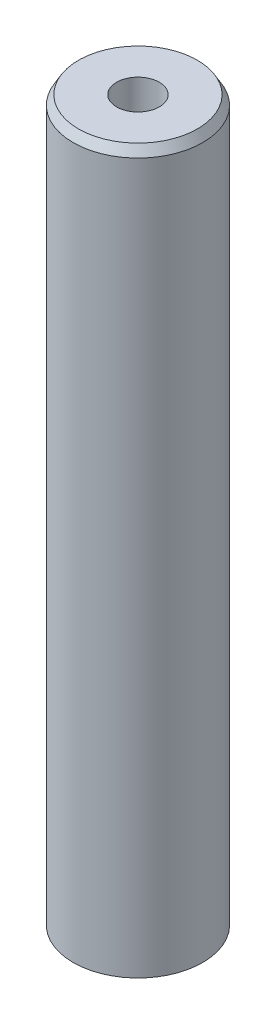
ISO-10303-21;
HEADER;
FILE_DESCRIPTION(('STEP AP214'),'2;1');
FILE_NAME('part.step','',(''),(''),'','','');
FILE_SCHEMA(('AUTOMOTIVE_DESIGN { 1 0 10303 214 1 1 1 1 }'));
ENDSEC;
DATA;
#1=APPLICATION_CONTEXT('core data for automotive mechanical design processes');
#2=APPLICATION_PROTOCOL_DEFINITION('international standard','automotive_design',2000,#1);
#3=PRODUCT_CONTEXT('',#1,'mechanical');
#4=PRODUCT('Part','Part','',(#3));
#5=PRODUCT_RELATED_PRODUCT_CATEGORY('part','',(#4));
#6=PRODUCT_DEFINITION_FORMATION('','',#4);
#7=PRODUCT_DEFINITION_CONTEXT('part definition',#1,'design');
#8=PRODUCT_DEFINITION('design','',#6,#7);
#9=PRODUCT_DEFINITION_SHAPE('','',#8);
#10=(LENGTH_UNIT() NAMED_UNIT(*) SI_UNIT(.MILLI.,.METRE.));
#11=(NAMED_UNIT(*) PLANE_ANGLE_UNIT() SI_UNIT($,.RADIAN.));
#12=(NAMED_UNIT(*) SI_UNIT($,.STERADIAN.) SOLID_ANGLE_UNIT());
#13=UNCERTAINTY_MEASURE_WITH_UNIT(LENGTH_MEASURE(1.E-05),#10,'distance_accuracy_value','');
#14=(GEOMETRIC_REPRESENTATION_CONTEXT(3) GLOBAL_UNCERTAINTY_ASSIGNED_CONTEXT((#13)) GLOBAL_UNIT_ASSIGNED_CONTEXT((#10,
#11,#12)) REPRESENTATION_CONTEXT('',''));
#15=CARTESIAN_POINT('',(0.,0.,0.));
#16=DIRECTION('',(0.,0.,1.));
#17=DIRECTION('',(1.,0.,0.));
#18=AXIS2_PLACEMENT_3D('',#15,#16,#17);
#19=CARTESIAN_POINT('',(0.,111.814988323432,0.));
#20=DIRECTION('',(0.,-1.,0.));
#21=DIRECTION('',(0.,0.,-1.));
#22=AXIS2_PLACEMENT_3D('',#19,#20,#21);
#23=CYLINDRICAL_SURFACE('',#22,10.);
#24=CARTESIAN_POINT('',(0.,110.394560322093,0.));
#25=DIRECTION('',(0.,1.,0.));
#26=DIRECTION('',(0.,0.,1.));
#27=AXIS2_PLACEMENT_3D('',#24,#25,#26);
#28=CIRCLE('',#27,10.);
#29=CARTESIAN_POINT('',(0.,110.394560322093,10.));
#30=VERTEX_POINT('',#29);
#31=EDGE_CURVE('E50',#30,#30,#28,.F.);
#32=ORIENTED_EDGE('',*,*,#31,.T.);
#33=EDGE_LOOP('',(#32));
#34=FACE_BOUND('',#33,.T.);
#35=CARTESIAN_POINT('',(0.,0.820084488937847,0.));
#36=DIRECTION('',(0.,1.,0.));
#37=DIRECTION('',(0.,0.,1.));
#38=AXIS2_PLACEMENT_3D('',#35,#36,#37);
#39=CIRCLE('',#38,10.);
#40=CARTESIAN_POINT('',(0.,0.820084488937847,10.));
#41=VERTEX_POINT('',#40);
#42=EDGE_CURVE('E51',#41,#41,#39,.T.);
#43=ORIENTED_EDGE('',*,*,#42,.T.);
#44=EDGE_LOOP('',(#43));
#45=FACE_BOUND('',#44,.T.);
#46=ADVANCED_FACE('F39',(#34,#45),#23,.T.);
#47=CARTESIAN_POINT('',(0.,111.814988323432,0.));
#48=DIRECTION('',(0.,1.,0.));
#49=DIRECTION('',(0.,0.,1.));
#50=AXIS2_PLACEMENT_3D('',#47,#48,#49);
#51=PLANE('',#50);
#52=CARTESIAN_POINT('',(0.,111.814988323432,0.));
#53=DIRECTION('',(0.,1.,0.));
#54=DIRECTION('',(0.,0.,1.));
#55=AXIS2_PLACEMENT_3D('',#52,#53,#54);
#56=CIRCLE('',#55,9.17991551106216);
#57=CARTESIAN_POINT('',(0.,111.814988323432,9.17991551106216));
#58=VERTEX_POINT('',#57);
#59=EDGE_CURVE('E54',#58,#58,#56,.T.);
#60=ORIENTED_EDGE('',*,*,#59,.T.);
#61=EDGE_LOOP('',(#60));
#62=FACE_BOUND('',#61,.T.);
#63=CARTESIAN_POINT('',(0.,111.814988323432,0.));
#64=DIRECTION('',(0.,1.,0.));
#65=DIRECTION('',(0.,0.,1.));
#66=AXIS2_PLACEMENT_3D('',#63,#64,#65);
#67=CIRCLE('',#66,3.29948056093381);
#68=CARTESIAN_POINT('',(0.,111.814988323432,3.29948056093381));
#69=VERTEX_POINT('',#68);
#70=EDGE_CURVE('E58',#69,#69,#67,.T.);
#71=ORIENTED_EDGE('',*,*,#70,.F.);
#72=EDGE_LOOP('',(#71));
#73=FACE_BOUND('',#72,.T.);
#74=ADVANCED_FACE('F69',(#62,#73),#51,.T.);
#75=CARTESIAN_POINT('',(0.,0.,0.));
#76=DIRECTION('',(0.,1.,0.));
#77=DIRECTION('',(0.,0.,1.));
#78=AXIS2_PLACEMENT_3D('',#75,#76,#77);
#79=PLANE('',#78);
#80=CARTESIAN_POINT('',(0.,0.,0.));
#81=DIRECTION('',(0.,1.,0.));
#82=DIRECTION('',(0.,0.,1.));
#83=AXIS2_PLACEMENT_3D('',#80,#81,#82);
#84=CIRCLE('',#83,8.5795719986605);
#85=CARTESIAN_POINT('',(0.,0.,8.5795719986605));
#86=VERTEX_POINT('',#85);
#87=EDGE_CURVE('E10',#86,#86,#84,.F.);
#88=ORIENTED_EDGE('',*,*,#87,.T.);
#89=EDGE_LOOP('',(#88));
#90=FACE_BOUND('',#89,.T.);
#91=CARTESIAN_POINT('',(0.,0.,0.));
#92=DIRECTION('',(0.,1.,0.));
#93=DIRECTION('',(0.,0.,1.));
#94=AXIS2_PLACEMENT_3D('',#91,#92,#93);
#95=CIRCLE('',#94,3.29948056093381);
#96=CARTESIAN_POINT('',(0.,0.,3.29948056093381));
#97=VERTEX_POINT('',#96);
#98=EDGE_CURVE('E63',#97,#97,#95,.T.);
#99=ORIENTED_EDGE('',*,*,#98,.T.);
#100=EDGE_LOOP('',(#99));
#101=FACE_BOUND('',#100,.T.);
#102=ADVANCED_FACE('F75',(#90,#101),#79,.F.);
#103=CARTESIAN_POINT('',(0.,111.814988323432,0.));
#104=DIRECTION('',(0.,-1.,0.));
#105=DIRECTION('',(0.,0.,-1.));
#106=AXIS2_PLACEMENT_3D('',#103,#104,#105);
#107=CYLINDRICAL_SURFACE('',#106,3.29948056093381);
#108=ORIENTED_EDGE('',*,*,#70,.T.);
#109=EDGE_LOOP('',(#108));
#110=FACE_BOUND('',#109,.T.);
#111=ORIENTED_EDGE('',*,*,#98,.F.);
#112=EDGE_LOOP('',(#111));
#113=FACE_BOUND('',#112,.T.);
#114=ADVANCED_FACE('F70',(#110,#113),#107,.F.);
#115=CARTESIAN_POINT('',(0.,111.814988323432,0.));
#116=DIRECTION('',(0.,-1.,0.));
#117=DIRECTION('',(0.,0.,-1.));
#118=AXIS2_PLACEMENT_3D('',#115,#116,#117);
#119=CONICAL_SURFACE('',#118,9.17991551106216,0.523598775598292);
#120=ORIENTED_EDGE('',*,*,#31,.F.);
#121=EDGE_LOOP('',(#120));
#122=FACE_BOUND('',#121,.T.);
#123=ORIENTED_EDGE('',*,*,#59,.F.);
#124=EDGE_LOOP('',(#123));
#125=FACE_BOUND('',#124,.T.);
#126=ADVANCED_FACE('F81',(#122,#125),#119,.T.);
#127=CARTESIAN_POINT('',(0.,0.820084488937847,0.));
#128=DIRECTION('',(0.,1.,0.));
#129=DIRECTION('',(0.,0.,1.));
#130=AXIS2_PLACEMENT_3D('',#127,#128,#129);
#131=CONICAL_SURFACE('',#130,10.,1.0471975511966);
#132=ORIENTED_EDGE('',*,*,#87,.F.);
#133=EDGE_LOOP('',(#132));
#134=FACE_BOUND('',#133,.T.);
#135=ORIENTED_EDGE('',*,*,#42,.F.);
#136=EDGE_LOOP('',(#135));
#137=FACE_BOUND('',#136,.T.);
#138=ADVANCED_FACE('F45',(#134,#137),#131,.T.);
#139=CLOSED_SHELL('',(#46,#74,#102,#114,#126,#138));
#140=MANIFOLD_SOLID_BREP('B2',#139);
#141=ADVANCED_BREP_SHAPE_REPRESENTATION('',(#18,#140),#14);
#142=SHAPE_DEFINITION_REPRESENTATION(#9,#141);
ENDSEC;
END-ISO-10303-21;
